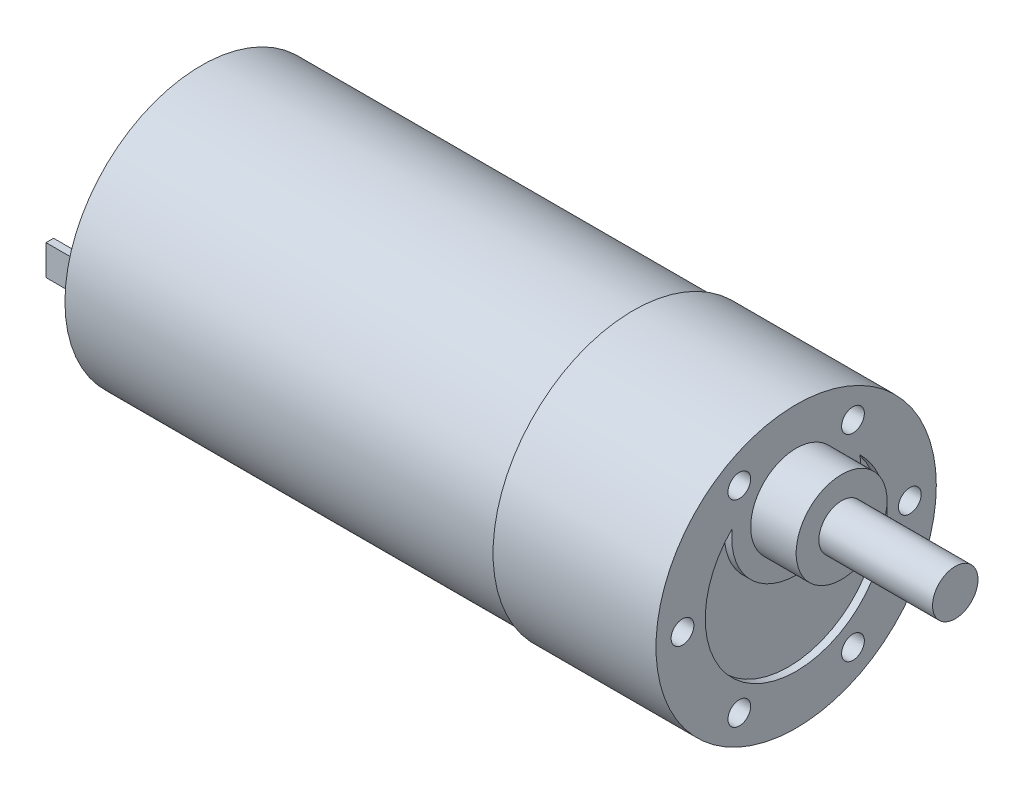
ISO-10303-21;
HEADER;
FILE_DESCRIPTION(('STEP AP214'),'2;1');
FILE_NAME('part.step','',(''),(''),'','','');
FILE_SCHEMA(('AUTOMOTIVE_DESIGN { 1 0 10303 214 1 1 1 1 }'));
ENDSEC;
DATA;
#1=APPLICATION_CONTEXT('core data for automotive mechanical design processes');
#2=APPLICATION_PROTOCOL_DEFINITION('international standard','automotive_design',2000,#1);
#3=PRODUCT_CONTEXT('',#1,'mechanical');
#4=PRODUCT('Part','Part','',(#3));
#5=PRODUCT_RELATED_PRODUCT_CATEGORY('part','',(#4));
#6=PRODUCT_DEFINITION_FORMATION('','',#4);
#7=PRODUCT_DEFINITION_CONTEXT('part definition',#1,'design');
#8=PRODUCT_DEFINITION('design','',#6,#7);
#9=PRODUCT_DEFINITION_SHAPE('','',#8);
#10=(LENGTH_UNIT() NAMED_UNIT(*) SI_UNIT(.MILLI.,.METRE.));
#11=(NAMED_UNIT(*) PLANE_ANGLE_UNIT() SI_UNIT($,.RADIAN.));
#12=(NAMED_UNIT(*) SI_UNIT($,.STERADIAN.) SOLID_ANGLE_UNIT());
#13=UNCERTAINTY_MEASURE_WITH_UNIT(LENGTH_MEASURE(1.E-05),#10,'distance_accuracy_value','');
#14=(GEOMETRIC_REPRESENTATION_CONTEXT(3) GLOBAL_UNCERTAINTY_ASSIGNED_CONTEXT((#13)) GLOBAL_UNIT_ASSIGNED_CONTEXT((#10,
#11,#12)) REPRESENTATION_CONTEXT('',''));
#15=CARTESIAN_POINT('',(0.,0.,0.));
#16=DIRECTION('',(0.,0.,1.));
#17=DIRECTION('',(1.,0.,0.));
#18=AXIS2_PLACEMENT_3D('',#15,#16,#17);
#19=CARTESIAN_POINT('',(21.5,0.,0.));
#20=DIRECTION('',(1.,0.,0.));
#21=DIRECTION('',(0.,0.,-1.));
#22=AXIS2_PLACEMENT_3D('',#19,#20,#21);
#23=PLANE('',#22);
#24=CARTESIAN_POINT('',(21.5,0.,15.));
#25=DIRECTION('',(1.,0.,0.));
#26=DIRECTION('',(0.,0.,-1.));
#27=AXIS2_PLACEMENT_3D('',#24,#25,#26);
#28=CIRCLE('',#27,1.5);
#29=CARTESIAN_POINT('',(21.5,0.,13.5));
#30=VERTEX_POINT('',#29);
#31=EDGE_CURVE('E377',#30,#30,#28,.T.);
#32=ORIENTED_EDGE('',*,*,#31,.F.);
#33=EDGE_LOOP('',(#32));
#34=FACE_BOUND('',#33,.T.);
#35=CARTESIAN_POINT('',(21.5,-12.9903810567665,7.50000000000015));
#36=DIRECTION('',(1.,0.,0.));
#37=DIRECTION('',(0.,0.,-1.));
#38=AXIS2_PLACEMENT_3D('',#35,#36,#37);
#39=CIRCLE('',#38,1.5);
#40=CARTESIAN_POINT('',(21.5,-12.9903810567665,6.00000000000014));
#41=VERTEX_POINT('',#40);
#42=EDGE_CURVE('E369',#41,#41,#39,.T.);
#43=ORIENTED_EDGE('',*,*,#42,.F.);
#44=EDGE_LOOP('',(#43));
#45=FACE_BOUND('',#44,.T.);
#46=CARTESIAN_POINT('',(21.5,-12.9903810567667,-7.49999999999988));
#47=DIRECTION('',(1.,0.,0.));
#48=DIRECTION('',(0.,0.,-1.));
#49=AXIS2_PLACEMENT_3D('',#46,#47,#48);
#50=CIRCLE('',#49,1.5);
#51=CARTESIAN_POINT('',(21.5,-12.9903810567667,-8.99999999999988));
#52=VERTEX_POINT('',#51);
#53=EDGE_CURVE('E362',#52,#52,#50,.T.);
#54=ORIENTED_EDGE('',*,*,#53,.F.);
#55=EDGE_LOOP('',(#54));
#56=FACE_BOUND('',#55,.T.);
#57=CARTESIAN_POINT('',(21.5,-1.02907469966573E-13,-15.));
#58=DIRECTION('',(1.,0.,0.));
#59=DIRECTION('',(0.,0.,-1.));
#60=AXIS2_PLACEMENT_3D('',#57,#58,#59);
#61=CIRCLE('',#60,1.5);
#62=CARTESIAN_POINT('',(21.5,-1.02907469966573E-13,-16.5));
#63=VERTEX_POINT('',#62);
#64=EDGE_CURVE('E367',#63,#63,#61,.T.);
#65=ORIENTED_EDGE('',*,*,#64,.F.);
#66=EDGE_LOOP('',(#65));
#67=FACE_BOUND('',#66,.T.);
#68=CARTESIAN_POINT('',(21.5,12.9903810567666,-7.50000000000006));
#69=DIRECTION('',(1.,0.,0.));
#70=DIRECTION('',(0.,0.,-1.));
#71=AXIS2_PLACEMENT_3D('',#68,#69,#70);
#72=CIRCLE('',#71,1.5);
#73=CARTESIAN_POINT('',(21.5,12.9903810567666,-9.00000000000006));
#74=VERTEX_POINT('',#73);
#75=EDGE_CURVE('E383',#74,#74,#72,.T.);
#76=ORIENTED_EDGE('',*,*,#75,.F.);
#77=EDGE_LOOP('',(#76));
#78=FACE_BOUND('',#77,.T.);
#79=CARTESIAN_POINT('',(21.5,12.9903810567666,7.49999999999997));
#80=DIRECTION('',(1.,0.,0.));
#81=DIRECTION('',(0.,0.,-1.));
#82=AXIS2_PLACEMENT_3D('',#79,#80,#81);
#83=CIRCLE('',#82,1.5);
#84=CARTESIAN_POINT('',(21.5,12.9903810567666,5.99999999999997));
#85=VERTEX_POINT('',#84);
#86=EDGE_CURVE('E386',#85,#85,#83,.T.);
#87=ORIENTED_EDGE('',*,*,#86,.F.);
#88=EDGE_LOOP('',(#87));
#89=FACE_BOUND('',#88,.T.);
#90=CARTESIAN_POINT('',(21.5,7.5,0.));
#91=DIRECTION('',(1.,0.,0.));
#92=DIRECTION('',(0.,0.,-1.));
#93=AXIS2_PLACEMENT_3D('',#90,#91,#92);
#94=CIRCLE('',#93,6.);
#95=CARTESIAN_POINT('',(21.5,7.5,-6.));
#96=VERTEX_POINT('',#95);
#97=EDGE_CURVE('E142',#96,#96,#94,.T.);
#98=ORIENTED_EDGE('',*,*,#97,.F.);
#99=EDGE_LOOP('',(#98));
#100=FACE_BOUND('',#99,.T.);
#101=CARTESIAN_POINT('',(21.5,0.,0.));
#102=DIRECTION('',(1.,0.,0.));
#103=DIRECTION('',(0.,0.,-1.));
#104=AXIS2_PLACEMENT_3D('',#101,#102,#103);
#105=CIRCLE('',#104,18.5);
#106=CARTESIAN_POINT('',(21.5,0.,-18.5));
#107=VERTEX_POINT('',#106);
#108=EDGE_CURVE('E47',#107,#107,#105,.T.);
#109=ORIENTED_EDGE('',*,*,#108,.T.);
#110=EDGE_LOOP('',(#109));
#111=FACE_BOUND('',#110,.T.);
#112=CARTESIAN_POINT('',(21.5,0.,0.));
#113=DIRECTION('',(1.,0.,0.));
#114=DIRECTION('',(0.,0.,-1.));
#115=AXIS2_PLACEMENT_3D('',#112,#113,#114);
#116=CIRCLE('',#115,12.);
#117=CARTESIAN_POINT('',(21.5,8.53333333333334,8.4369557437634));
#118=VERTEX_POINT('',#117);
#119=CARTESIAN_POINT('',(21.5,8.53333333333333,-8.4369557437634));
#120=VERTEX_POINT('',#119);
#121=EDGE_CURVE('E128',#118,#120,#116,.T.);
#122=ORIENTED_EDGE('',*,*,#121,.F.);
#123=CARTESIAN_POINT('',(21.5,7.5,0.));
#124=DIRECTION('',(1.,0.,0.));
#125=DIRECTION('',(0.,0.,-1.));
#126=AXIS2_PLACEMENT_3D('',#123,#124,#125);
#127=CIRCLE('',#126,8.5);
#128=EDGE_CURVE('E54',#118,#120,#127,.T.);
#129=ORIENTED_EDGE('',*,*,#128,.T.);
#130=EDGE_LOOP('',(#122,#129));
#131=FACE_BOUND('',#130,.T.);
#132=ADVANCED_FACE('F39',(#34,#45,#56,#67,#78,#89,#100,#111,#131),#23,.T.);
#133=CARTESIAN_POINT('',(-57.,0.,0.));
#134=DIRECTION('',(-1.,0.,0.));
#135=DIRECTION('',(0.,0.,1.));
#136=AXIS2_PLACEMENT_3D('',#133,#134,#135);
#137=PLANE('',#136);
#138=DIRECTION('',(0.,0.,-1.));
#139=VECTOR('',#138,1.);
#140=CARTESIAN_POINT('',(-57.,-2.00000000000001,-13.5));
#141=LINE('',#140,#139);
#142=CARTESIAN_POINT('',(-57.,-2.00000000000001,-13.5));
#143=VERTEX_POINT('',#142);
#144=CARTESIAN_POINT('',(-57.,-2.00000000000001,-14.5));
#145=VERTEX_POINT('',#144);
#146=EDGE_CURVE('E171',#143,#145,#141,.T.);
#147=ORIENTED_EDGE('',*,*,#146,.T.);
#148=DIRECTION('',(0.,1.,0.));
#149=VECTOR('',#148,1.);
#150=CARTESIAN_POINT('',(-57.,-2.00000000000001,-14.5));
#151=LINE('',#150,#149);
#152=CARTESIAN_POINT('',(-57.,1.99999999999999,-14.5));
#153=VERTEX_POINT('',#152);
#154=EDGE_CURVE('E194',#145,#153,#151,.T.);
#155=ORIENTED_EDGE('',*,*,#154,.T.);
#156=DIRECTION('',(0.,0.,-1.));
#157=VECTOR('',#156,1.);
#158=CARTESIAN_POINT('',(-57.,1.99999999999999,-13.5));
#159=LINE('',#158,#157);
#160=CARTESIAN_POINT('',(-57.,1.99999999999999,-13.5));
#161=VERTEX_POINT('',#160);
#162=EDGE_CURVE('E196',#161,#153,#159,.T.);
#163=ORIENTED_EDGE('',*,*,#162,.F.);
#164=DIRECTION('',(0.,1.,0.));
#165=VECTOR('',#164,1.);
#166=CARTESIAN_POINT('',(-57.,-2.00000000000001,-13.5));
#167=LINE('',#166,#165);
#168=EDGE_CURVE('E185',#143,#161,#167,.T.);
#169=ORIENTED_EDGE('',*,*,#168,.F.);
#170=EDGE_LOOP('',(#147,#155,#163,#169));
#171=FACE_BOUND('',#170,.T.);
#172=CARTESIAN_POINT('',(-57.,0.,0.));
#173=DIRECTION('',(-1.,0.,0.));
#174=DIRECTION('',(0.,0.,1.));
#175=AXIS2_PLACEMENT_3D('',#172,#173,#174);
#176=CIRCLE('',#175,18.);
#177=CARTESIAN_POINT('',(-57.,0.,18.));
#178=VERTEX_POINT('',#177);
#179=EDGE_CURVE('E204',#178,#178,#176,.T.);
#180=ORIENTED_EDGE('',*,*,#179,.T.);
#181=EDGE_LOOP('',(#180));
#182=FACE_BOUND('',#181,.T.);
#183=DIRECTION('',(0.,1.,0.));
#184=VECTOR('',#183,1.);
#185=CARTESIAN_POINT('',(-57.,-2.,14.5));
#186=LINE('',#185,#184);
#187=CARTESIAN_POINT('',(-57.,-2.,14.5));
#188=VERTEX_POINT('',#187);
#189=CARTESIAN_POINT('',(-57.,2.,14.5));
#190=VERTEX_POINT('',#189);
#191=EDGE_CURVE('E62',#188,#190,#186,.T.);
#192=ORIENTED_EDGE('',*,*,#191,.F.);
#193=DIRECTION('',(0.,0.,1.));
#194=VECTOR('',#193,1.);
#195=CARTESIAN_POINT('',(-57.,-2.,13.5));
#196=LINE('',#195,#194);
#197=CARTESIAN_POINT('',(-57.,-2.,13.5));
#198=VERTEX_POINT('',#197);
#199=EDGE_CURVE('E168',#198,#188,#196,.T.);
#200=ORIENTED_EDGE('',*,*,#199,.F.);
#201=DIRECTION('',(0.,1.,0.));
#202=VECTOR('',#201,1.);
#203=CARTESIAN_POINT('',(-57.,-2.,13.5));
#204=LINE('',#203,#202);
#205=CARTESIAN_POINT('',(-57.,2.,13.5));
#206=VERTEX_POINT('',#205);
#207=EDGE_CURVE('E162',#198,#206,#204,.T.);
#208=ORIENTED_EDGE('',*,*,#207,.T.);
#209=DIRECTION('',(0.,0.,1.));
#210=VECTOR('',#209,1.);
#211=CARTESIAN_POINT('',(-57.,2.,13.5));
#212=LINE('',#211,#210);
#213=EDGE_CURVE('E164',#206,#190,#212,.T.);
#214=ORIENTED_EDGE('',*,*,#213,.T.);
#215=EDGE_LOOP('',(#192,#200,#208,#214));
#216=FACE_BOUND('',#215,.T.);
#217=ADVANCED_FACE('F232',(#171,#182,#216),#137,.T.);
#218=CARTESIAN_POINT('',(21.5,0.,0.));
#219=DIRECTION('',(-1.,0.,0.));
#220=DIRECTION('',(0.,0.,1.));
#221=AXIS2_PLACEMENT_3D('',#218,#219,#220);
#222=CYLINDRICAL_SURFACE('',#221,18.5);
#223=ORIENTED_EDGE('',*,*,#108,.F.);
#224=EDGE_LOOP('',(#223));
#225=FACE_BOUND('',#224,.T.);
#226=CARTESIAN_POINT('',(0.,0.,0.));
#227=DIRECTION('',(1.,0.,0.));
#228=DIRECTION('',(0.,0.,-1.));
#229=AXIS2_PLACEMENT_3D('',#226,#227,#228);
#230=CIRCLE('',#229,18.5);
#231=CARTESIAN_POINT('',(0.,0.,-18.5));
#232=VERTEX_POINT('',#231);
#233=EDGE_CURVE('E215',#232,#232,#230,.T.);
#234=ORIENTED_EDGE('',*,*,#233,.T.);
#235=EDGE_LOOP('',(#234));
#236=FACE_BOUND('',#235,.T.);
#237=ADVANCED_FACE('F41',(#225,#236),#222,.T.);
#238=CARTESIAN_POINT('',(0.,0.,0.));
#239=DIRECTION('',(1.,0.,0.));
#240=DIRECTION('',(0.,0.,-1.));
#241=AXIS2_PLACEMENT_3D('',#238,#239,#240);
#242=PLANE('',#241);
#243=CARTESIAN_POINT('',(0.,0.,0.));
#244=DIRECTION('',(1.,0.,0.));
#245=DIRECTION('',(0.,0.,-1.));
#246=AXIS2_PLACEMENT_3D('',#243,#244,#245);
#247=CIRCLE('',#246,18.);
#248=CARTESIAN_POINT('',(0.,0.,-18.));
#249=VERTEX_POINT('',#248);
#250=EDGE_CURVE('E11',#249,#249,#247,.F.);
#251=ORIENTED_EDGE('',*,*,#250,.F.);
#252=EDGE_LOOP('',(#251));
#253=FACE_BOUND('',#252,.T.);
#254=ORIENTED_EDGE('',*,*,#233,.F.);
#255=EDGE_LOOP('',(#254));
#256=FACE_BOUND('',#255,.T.);
#257=ADVANCED_FACE('F221',(#253,#256),#242,.F.);
#258=CARTESIAN_POINT('',(-57.,0.,0.));
#259=DIRECTION('',(1.,0.,0.));
#260=DIRECTION('',(0.,0.,-1.));
#261=AXIS2_PLACEMENT_3D('',#258,#259,#260);
#262=CYLINDRICAL_SURFACE('',#261,18.);
#263=ORIENTED_EDGE('',*,*,#179,.F.);
#264=EDGE_LOOP('',(#263));
#265=FACE_BOUND('',#264,.T.);
#266=ORIENTED_EDGE('',*,*,#250,.T.);
#267=EDGE_LOOP('',(#266));
#268=FACE_BOUND('',#267,.T.);
#269=ADVANCED_FACE('F223',(#265,#268),#262,.T.);
#270=CARTESIAN_POINT('',(-63.,-2.00000000000001,-13.5));
#271=DIRECTION('',(0.,-1.,0.));
#272=DIRECTION('',(0.,0.,-1.));
#273=AXIS2_PLACEMENT_3D('',#270,#271,#272);
#274=PLANE('',#273);
#275=ORIENTED_EDGE('',*,*,#146,.F.);
#276=DIRECTION('',(1.,0.,0.));
#277=VECTOR('',#276,1.);
#278=CARTESIAN_POINT('',(-63.,-2.00000000000001,-13.5));
#279=LINE('',#278,#277);
#280=CARTESIAN_POINT('',(-63.,-2.00000000000001,-13.5));
#281=VERTEX_POINT('',#280);
#282=EDGE_CURVE('E201',#281,#143,#279,.T.);
#283=ORIENTED_EDGE('',*,*,#282,.F.);
#284=DIRECTION('',(0.,0.,-1.));
#285=VECTOR('',#284,1.);
#286=CARTESIAN_POINT('',(-63.,-2.00000000000001,-13.5));
#287=LINE('',#286,#285);
#288=CARTESIAN_POINT('',(-63.,-2.00000000000001,-14.5));
#289=VERTEX_POINT('',#288);
#290=EDGE_CURVE('E181',#281,#289,#287,.T.);
#291=ORIENTED_EDGE('',*,*,#290,.T.);
#292=DIRECTION('',(1.,0.,0.));
#293=VECTOR('',#292,1.);
#294=CARTESIAN_POINT('',(-63.,-2.00000000000001,-14.5));
#295=LINE('',#294,#293);
#296=EDGE_CURVE('E192',#289,#145,#295,.T.);
#297=ORIENTED_EDGE('',*,*,#296,.T.);
#298=EDGE_LOOP('',(#275,#283,#291,#297));
#299=FACE_BOUND('',#298,.T.);
#300=ADVANCED_FACE('F229',(#299),#274,.T.);
#301=CARTESIAN_POINT('',(-63.,-2.00000000000001,-13.5));
#302=DIRECTION('',(0.,0.,-1.));
#303=DIRECTION('',(-1.,0.,0.));
#304=AXIS2_PLACEMENT_3D('',#301,#302,#303);
#305=PLANE('',#304);
#306=ORIENTED_EDGE('',*,*,#168,.T.);
#307=DIRECTION('',(1.,0.,0.));
#308=VECTOR('',#307,1.);
#309=CARTESIAN_POINT('',(-63.,1.99999999999999,-13.5));
#310=LINE('',#309,#308);
#311=CARTESIAN_POINT('',(-63.,1.99999999999999,-13.5));
#312=VERTEX_POINT('',#311);
#313=EDGE_CURVE('E205',#312,#161,#310,.T.);
#314=ORIENTED_EDGE('',*,*,#313,.F.);
#315=DIRECTION('',(0.,1.,0.));
#316=VECTOR('',#315,1.);
#317=CARTESIAN_POINT('',(-63.,-2.00000000000001,-13.5));
#318=LINE('',#317,#316);
#319=EDGE_CURVE('E190',#281,#312,#318,.T.);
#320=ORIENTED_EDGE('',*,*,#319,.F.);
#321=ORIENTED_EDGE('',*,*,#282,.T.);
#322=EDGE_LOOP('',(#306,#314,#320,#321));
#323=FACE_BOUND('',#322,.T.);
#324=ADVANCED_FACE('F248',(#323),#305,.F.);
#325=CARTESIAN_POINT('',(-63.,1.99999999999999,-13.5));
#326=DIRECTION('',(0.,-1.,0.));
#327=DIRECTION('',(0.,0.,-1.));
#328=AXIS2_PLACEMENT_3D('',#325,#326,#327);
#329=PLANE('',#328);
#330=ORIENTED_EDGE('',*,*,#162,.T.);
#331=DIRECTION('',(1.,0.,0.));
#332=VECTOR('',#331,1.);
#333=CARTESIAN_POINT('',(-63.,1.99999999999999,-14.5));
#334=LINE('',#333,#332);
#335=CARTESIAN_POINT('',(-63.,1.99999999999999,-14.5));
#336=VERTEX_POINT('',#335);
#337=EDGE_CURVE('E208',#336,#153,#334,.T.);
#338=ORIENTED_EDGE('',*,*,#337,.F.);
#339=DIRECTION('',(0.,0.,-1.));
#340=VECTOR('',#339,1.);
#341=CARTESIAN_POINT('',(-63.,1.99999999999999,-13.5));
#342=LINE('',#341,#340);
#343=EDGE_CURVE('E188',#312,#336,#342,.T.);
#344=ORIENTED_EDGE('',*,*,#343,.F.);
#345=ORIENTED_EDGE('',*,*,#313,.T.);
#346=EDGE_LOOP('',(#330,#338,#344,#345));
#347=FACE_BOUND('',#346,.T.);
#348=ADVANCED_FACE('F254',(#347),#329,.F.);
#349=CARTESIAN_POINT('',(-63.,-2.00000000000001,-14.5));
#350=DIRECTION('',(0.,0.,-1.));
#351=DIRECTION('',(-1.,0.,0.));
#352=AXIS2_PLACEMENT_3D('',#349,#350,#351);
#353=PLANE('',#352);
#354=ORIENTED_EDGE('',*,*,#154,.F.);
#355=ORIENTED_EDGE('',*,*,#296,.F.);
#356=DIRECTION('',(0.,1.,0.));
#357=VECTOR('',#356,1.);
#358=CARTESIAN_POINT('',(-63.,-2.00000000000001,-14.5));
#359=LINE('',#358,#357);
#360=EDGE_CURVE('E184',#289,#336,#359,.T.);
#361=ORIENTED_EDGE('',*,*,#360,.T.);
#362=ORIENTED_EDGE('',*,*,#337,.T.);
#363=EDGE_LOOP('',(#354,#355,#361,#362));
#364=FACE_BOUND('',#363,.T.);
#365=ADVANCED_FACE('F250',(#364),#353,.T.);
#366=CARTESIAN_POINT('',(-63.,0.,0.));
#367=DIRECTION('',(1.,0.,0.));
#368=DIRECTION('',(0.,0.,-1.));
#369=AXIS2_PLACEMENT_3D('',#366,#367,#368);
#370=PLANE('',#369);
#371=ORIENTED_EDGE('',*,*,#290,.F.);
#372=ORIENTED_EDGE('',*,*,#319,.T.);
#373=ORIENTED_EDGE('',*,*,#343,.T.);
#374=ORIENTED_EDGE('',*,*,#360,.F.);
#375=EDGE_LOOP('',(#371,#372,#373,#374));
#376=FACE_BOUND('',#375,.T.);
#377=ADVANCED_FACE('F253',(#376),#370,.F.);
#378=CARTESIAN_POINT('',(-63.,-2.,13.5));
#379=DIRECTION('',(0.,1.,0.));
#380=DIRECTION('',(0.,0.,1.));
#381=AXIS2_PLACEMENT_3D('',#378,#379,#380);
#382=PLANE('',#381);
#383=ORIENTED_EDGE('',*,*,#199,.T.);
#384=DIRECTION('',(1.,0.,0.));
#385=VECTOR('',#384,1.);
#386=CARTESIAN_POINT('',(-63.,-2.,14.5));
#387=LINE('',#386,#385);
#388=CARTESIAN_POINT('',(-63.,-2.,14.5));
#389=VERTEX_POINT('',#388);
#390=EDGE_CURVE('E148',#389,#188,#387,.T.);
#391=ORIENTED_EDGE('',*,*,#390,.F.);
#392=DIRECTION('',(0.,0.,1.));
#393=VECTOR('',#392,1.);
#394=CARTESIAN_POINT('',(-63.,-2.,13.5));
#395=LINE('',#394,#393);
#396=CARTESIAN_POINT('',(-63.,-2.,13.5));
#397=VERTEX_POINT('',#396);
#398=EDGE_CURVE('E165',#397,#389,#395,.T.);
#399=ORIENTED_EDGE('',*,*,#398,.F.);
#400=DIRECTION('',(1.,0.,0.));
#401=VECTOR('',#400,1.);
#402=CARTESIAN_POINT('',(-63.,-2.,13.5));
#403=LINE('',#402,#401);
#404=EDGE_CURVE('E158',#397,#198,#403,.T.);
#405=ORIENTED_EDGE('',*,*,#404,.T.);
#406=EDGE_LOOP('',(#383,#391,#399,#405));
#407=FACE_BOUND('',#406,.T.);
#408=ADVANCED_FACE('F264',(#407),#382,.F.);
#409=CARTESIAN_POINT('',(-63.,-2.,14.5));
#410=DIRECTION('',(0.,0.,-1.));
#411=DIRECTION('',(-1.,0.,0.));
#412=AXIS2_PLACEMENT_3D('',#409,#410,#411);
#413=PLANE('',#412);
#414=ORIENTED_EDGE('',*,*,#191,.T.);
#415=DIRECTION('',(1.,0.,0.));
#416=VECTOR('',#415,1.);
#417=CARTESIAN_POINT('',(-63.,2.,14.5));
#418=LINE('',#417,#416);
#419=CARTESIAN_POINT('',(-63.,2.,14.5));
#420=VERTEX_POINT('',#419);
#421=EDGE_CURVE('E152',#420,#190,#418,.T.);
#422=ORIENTED_EDGE('',*,*,#421,.F.);
#423=DIRECTION('',(0.,1.,0.));
#424=VECTOR('',#423,1.);
#425=CARTESIAN_POINT('',(-63.,-2.,14.5));
#426=LINE('',#425,#424);
#427=EDGE_CURVE('E177',#389,#420,#426,.T.);
#428=ORIENTED_EDGE('',*,*,#427,.F.);
#429=ORIENTED_EDGE('',*,*,#390,.T.);
#430=EDGE_LOOP('',(#414,#422,#428,#429));
#431=FACE_BOUND('',#430,.T.);
#432=ADVANCED_FACE('F278',(#431),#413,.F.);
#433=CARTESIAN_POINT('',(-63.,2.,13.5));
#434=DIRECTION('',(0.,1.,0.));
#435=DIRECTION('',(0.,0.,1.));
#436=AXIS2_PLACEMENT_3D('',#433,#434,#435);
#437=PLANE('',#436);
#438=ORIENTED_EDGE('',*,*,#213,.F.);
#439=DIRECTION('',(1.,0.,0.));
#440=VECTOR('',#439,1.);
#441=CARTESIAN_POINT('',(-63.,2.,13.5));
#442=LINE('',#441,#440);
#443=CARTESIAN_POINT('',(-63.,2.,13.5));
#444=VERTEX_POINT('',#443);
#445=EDGE_CURVE('E155',#444,#206,#442,.T.);
#446=ORIENTED_EDGE('',*,*,#445,.F.);
#447=DIRECTION('',(0.,0.,1.));
#448=VECTOR('',#447,1.);
#449=CARTESIAN_POINT('',(-63.,2.,13.5));
#450=LINE('',#449,#448);
#451=EDGE_CURVE('E174',#444,#420,#450,.T.);
#452=ORIENTED_EDGE('',*,*,#451,.T.);
#453=ORIENTED_EDGE('',*,*,#421,.T.);
#454=EDGE_LOOP('',(#438,#446,#452,#453));
#455=FACE_BOUND('',#454,.T.);
#456=ADVANCED_FACE('F274',(#455),#437,.T.);
#457=CARTESIAN_POINT('',(-63.,-2.,13.5));
#458=DIRECTION('',(0.,0.,-1.));
#459=DIRECTION('',(-1.,0.,0.));
#460=AXIS2_PLACEMENT_3D('',#457,#458,#459);
#461=PLANE('',#460);
#462=ORIENTED_EDGE('',*,*,#207,.F.);
#463=ORIENTED_EDGE('',*,*,#404,.F.);
#464=DIRECTION('',(0.,1.,0.));
#465=VECTOR('',#464,1.);
#466=CARTESIAN_POINT('',(-63.,-2.,13.5));
#467=LINE('',#466,#465);
#468=EDGE_CURVE('E161',#397,#444,#467,.T.);
#469=ORIENTED_EDGE('',*,*,#468,.T.);
#470=ORIENTED_EDGE('',*,*,#445,.T.);
#471=EDGE_LOOP('',(#462,#463,#469,#470));
#472=FACE_BOUND('',#471,.T.);
#473=ADVANCED_FACE('F270',(#472),#461,.T.);
#474=CARTESIAN_POINT('',(-63.,0.,0.));
#475=DIRECTION('',(-1.,0.,0.));
#476=DIRECTION('',(0.,0.,1.));
#477=AXIS2_PLACEMENT_3D('',#474,#475,#476);
#478=PLANE('',#477);
#479=ORIENTED_EDGE('',*,*,#398,.T.);
#480=ORIENTED_EDGE('',*,*,#427,.T.);
#481=ORIENTED_EDGE('',*,*,#451,.F.);
#482=ORIENTED_EDGE('',*,*,#468,.F.);
#483=EDGE_LOOP('',(#479,#480,#481,#482));
#484=FACE_BOUND('',#483,.T.);
#485=ADVANCED_FACE('F266',(#484),#478,.T.);
#486=CARTESIAN_POINT('',(27.5,7.5,0.));
#487=DIRECTION('',(-1.,0.,0.));
#488=DIRECTION('',(0.,0.,1.));
#489=AXIS2_PLACEMENT_3D('',#486,#487,#488);
#490=CYLINDRICAL_SURFACE('',#489,6.);
#491=CARTESIAN_POINT('',(27.5,7.5,0.));
#492=DIRECTION('',(1.,0.,0.));
#493=DIRECTION('',(0.,0.,-1.));
#494=AXIS2_PLACEMENT_3D('',#491,#492,#493);
#495=CIRCLE('',#494,6.);
#496=CARTESIAN_POINT('',(27.5,7.5,-6.));
#497=VERTEX_POINT('',#496);
#498=EDGE_CURVE('E145',#497,#497,#495,.T.);
#499=ORIENTED_EDGE('',*,*,#498,.F.);
#500=EDGE_LOOP('',(#499));
#501=FACE_BOUND('',#500,.T.);
#502=ORIENTED_EDGE('',*,*,#97,.T.);
#503=EDGE_LOOP('',(#502));
#504=FACE_BOUND('',#503,.T.);
#505=ADVANCED_FACE('F269',(#501,#504),#490,.T.);
#506=CARTESIAN_POINT('',(27.5,0.,0.));
#507=DIRECTION('',(1.,0.,0.));
#508=DIRECTION('',(0.,0.,-1.));
#509=AXIS2_PLACEMENT_3D('',#506,#507,#508);
#510=PLANE('',#509);
#511=CARTESIAN_POINT('',(27.5,7.5,0.));
#512=DIRECTION('',(1.,0.,0.));
#513=DIRECTION('',(0.,0.,-1.));
#514=AXIS2_PLACEMENT_3D('',#511,#512,#513);
#515=CIRCLE('',#514,3.);
#516=CARTESIAN_POINT('',(27.5,7.5,-3.));
#517=VERTEX_POINT('',#516);
#518=EDGE_CURVE('E137',#517,#517,#515,.T.);
#519=ORIENTED_EDGE('',*,*,#518,.F.);
#520=EDGE_LOOP('',(#519));
#521=FACE_BOUND('',#520,.T.);
#522=ORIENTED_EDGE('',*,*,#498,.T.);
#523=EDGE_LOOP('',(#522));
#524=FACE_BOUND('',#523,.T.);
#525=ADVANCED_FACE('F288',(#521,#524),#510,.T.);
#526=CARTESIAN_POINT('',(42.5,7.5,0.));
#527=DIRECTION('',(-1.,0.,0.));
#528=DIRECTION('',(0.,0.,1.));
#529=AXIS2_PLACEMENT_3D('',#526,#527,#528);
#530=CYLINDRICAL_SURFACE('',#529,3.);
#531=CARTESIAN_POINT('',(42.5,7.5,0.));
#532=DIRECTION('',(1.,0.,0.));
#533=DIRECTION('',(0.,0.,-1.));
#534=AXIS2_PLACEMENT_3D('',#531,#532,#533);
#535=CIRCLE('',#534,3.);
#536=CARTESIAN_POINT('',(42.5,7.5,-3.));
#537=VERTEX_POINT('',#536);
#538=EDGE_CURVE('E139',#537,#537,#535,.T.);
#539=ORIENTED_EDGE('',*,*,#538,.F.);
#540=EDGE_LOOP('',(#539));
#541=FACE_BOUND('',#540,.T.);
#542=ORIENTED_EDGE('',*,*,#518,.T.);
#543=EDGE_LOOP('',(#542));
#544=FACE_BOUND('',#543,.T.);
#545=ADVANCED_FACE('F292',(#541,#544),#530,.T.);
#546=CARTESIAN_POINT('',(42.5,7.5,0.));
#547=DIRECTION('',(1.,0.,0.));
#548=DIRECTION('',(0.,0.,-1.));
#549=AXIS2_PLACEMENT_3D('',#546,#547,#548);
#550=PLANE('',#549);
#551=ORIENTED_EDGE('',*,*,#538,.T.);
#552=EDGE_LOOP('',(#551));
#553=FACE_BOUND('',#552,.T.);
#554=ADVANCED_FACE('F296',(#553),#550,.T.);
#555=CARTESIAN_POINT('',(20.5,7.5,0.));
#556=DIRECTION('',(1.,0.,0.));
#557=DIRECTION('',(0.,0.,-1.));
#558=AXIS2_PLACEMENT_3D('',#555,#556,#557);
#559=CYLINDRICAL_SURFACE('',#558,8.5);
#560=ORIENTED_EDGE('',*,*,#128,.F.);
#561=DIRECTION('',(1.,0.,0.));
#562=VECTOR('',#561,1.);
#563=CARTESIAN_POINT('',(20.5,8.53333333333334,8.4369557437634));
#564=LINE('',#563,#562);
#565=CARTESIAN_POINT('',(20.5,8.53333333333334,8.4369557437634));
#566=VERTEX_POINT('',#565);
#567=EDGE_CURVE('E113',#566,#118,#564,.T.);
#568=ORIENTED_EDGE('',*,*,#567,.F.);
#569=CARTESIAN_POINT('',(20.5,7.5,0.));
#570=DIRECTION('',(1.,0.,0.));
#571=DIRECTION('',(0.,0.,-1.));
#572=AXIS2_PLACEMENT_3D('',#569,#570,#571);
#573=CIRCLE('',#572,8.5);
#574=CARTESIAN_POINT('',(20.5,8.53333333333333,-8.4369557437634));
#575=VERTEX_POINT('',#574);
#576=EDGE_CURVE('E116',#566,#575,#573,.T.);
#577=ORIENTED_EDGE('',*,*,#576,.T.);
#578=DIRECTION('',(1.,0.,0.));
#579=VECTOR('',#578,1.);
#580=CARTESIAN_POINT('',(20.5,8.53333333333333,-8.4369557437634));
#581=LINE('',#580,#579);
#582=EDGE_CURVE('E122',#575,#120,#581,.T.);
#583=ORIENTED_EDGE('',*,*,#582,.T.);
#584=EDGE_LOOP('',(#560,#568,#577,#583));
#585=FACE_BOUND('',#584,.T.);
#586=ADVANCED_FACE('F115',(#585),#559,.T.);
#587=CARTESIAN_POINT('',(20.5,0.,0.));
#588=DIRECTION('',(1.,0.,0.));
#589=DIRECTION('',(0.,0.,-1.));
#590=AXIS2_PLACEMENT_3D('',#587,#588,#589);
#591=CYLINDRICAL_SURFACE('',#590,12.);
#592=ORIENTED_EDGE('',*,*,#121,.T.);
#593=ORIENTED_EDGE('',*,*,#582,.F.);
#594=CARTESIAN_POINT('',(20.5,0.,0.));
#595=DIRECTION('',(1.,0.,0.));
#596=DIRECTION('',(0.,0.,-1.));
#597=AXIS2_PLACEMENT_3D('',#594,#595,#596);
#598=CIRCLE('',#597,12.);
#599=EDGE_CURVE('E123',#566,#575,#598,.T.);
#600=ORIENTED_EDGE('',*,*,#599,.F.);
#601=ORIENTED_EDGE('',*,*,#567,.T.);
#602=EDGE_LOOP('',(#592,#593,#600,#601));
#603=FACE_BOUND('',#602,.T.);
#604=ADVANCED_FACE('F130',(#603),#591,.F.);
#605=CARTESIAN_POINT('',(20.5,0.,0.));
#606=DIRECTION('',(1.,0.,0.));
#607=DIRECTION('',(0.,0.,-1.));
#608=AXIS2_PLACEMENT_3D('',#605,#606,#607);
#609=PLANE('',#608);
#610=ORIENTED_EDGE('',*,*,#576,.F.);
#611=ORIENTED_EDGE('',*,*,#599,.T.);
#612=EDGE_LOOP('',(#610,#611));
#613=FACE_BOUND('',#612,.T.);
#614=ADVANCED_FACE('F127',(#613),#609,.T.);
#615=CARTESIAN_POINT('',(16.5,12.9903810567666,7.49999999999997));
#616=DIRECTION('',(1.,0.,0.));
#617=DIRECTION('',(0.,0.,-1.));
#618=AXIS2_PLACEMENT_3D('',#615,#616,#617);
#619=CYLINDRICAL_SURFACE('',#618,1.5);
#620=CARTESIAN_POINT('',(16.5,12.9903810567666,7.49999999999997));
#621=DIRECTION('',(1.,0.,0.));
#622=DIRECTION('',(0.,0.,-1.));
#623=AXIS2_PLACEMENT_3D('',#620,#621,#622);
#624=CIRCLE('',#623,1.5);
#625=CARTESIAN_POINT('',(16.5,12.9903810567666,5.99999999999997));
#626=VERTEX_POINT('',#625);
#627=EDGE_CURVE('E135',#626,#626,#624,.T.);
#628=ORIENTED_EDGE('',*,*,#627,.F.);
#629=EDGE_LOOP('',(#628));
#630=FACE_BOUND('',#629,.T.);
#631=ORIENTED_EDGE('',*,*,#86,.T.);
#632=EDGE_LOOP('',(#631));
#633=FACE_BOUND('',#632,.T.);
#634=ADVANCED_FACE('F307',(#630,#633),#619,.F.);
#635=CARTESIAN_POINT('',(16.5,12.9903810567666,7.49999999999997));
#636=DIRECTION('',(1.,0.,0.));
#637=DIRECTION('',(0.,0.,-1.));
#638=AXIS2_PLACEMENT_3D('',#635,#636,#637);
#639=PLANE('',#638);
#640=ORIENTED_EDGE('',*,*,#627,.T.);
#641=EDGE_LOOP('',(#640));
#642=FACE_BOUND('',#641,.T.);
#643=ADVANCED_FACE('F310',(#642),#639,.T.);
#644=CARTESIAN_POINT('',(16.5,12.9903810567666,-7.50000000000006));
#645=DIRECTION('',(1.,0.,0.));
#646=DIRECTION('',(0.,0.,-1.));
#647=AXIS2_PLACEMENT_3D('',#644,#645,#646);
#648=CYLINDRICAL_SURFACE('',#647,1.5);
#649=CARTESIAN_POINT('',(16.5,12.9903810567666,-7.50000000000006));
#650=DIRECTION('',(1.,0.,0.));
#651=DIRECTION('',(0.,0.,-1.));
#652=AXIS2_PLACEMENT_3D('',#649,#650,#651);
#653=CIRCLE('',#652,1.5);
#654=CARTESIAN_POINT('',(16.5,12.9903810567666,-9.00000000000006));
#655=VERTEX_POINT('',#654);
#656=EDGE_CURVE('E387',#655,#655,#653,.T.);
#657=ORIENTED_EDGE('',*,*,#656,.F.);
#658=EDGE_LOOP('',(#657));
#659=FACE_BOUND('',#658,.T.);
#660=ORIENTED_EDGE('',*,*,#75,.T.);
#661=EDGE_LOOP('',(#660));
#662=FACE_BOUND('',#661,.T.);
#663=ADVANCED_FACE('F314',(#659,#662),#648,.F.);
#664=CARTESIAN_POINT('',(16.5,12.9903810567666,-7.50000000000006));
#665=DIRECTION('',(1.,0.,0.));
#666=DIRECTION('',(0.,0.,-1.));
#667=AXIS2_PLACEMENT_3D('',#664,#665,#666);
#668=PLANE('',#667);
#669=ORIENTED_EDGE('',*,*,#656,.T.);
#670=EDGE_LOOP('',(#669));
#671=FACE_BOUND('',#670,.T.);
#672=ADVANCED_FACE('F324',(#671),#668,.T.);
#673=CARTESIAN_POINT('',(16.5,-1.02907469966573E-13,-15.));
#674=DIRECTION('',(1.,0.,0.));
#675=DIRECTION('',(0.,0.,-1.));
#676=AXIS2_PLACEMENT_3D('',#673,#674,#675);
#677=CYLINDRICAL_SURFACE('',#676,1.5);
#678=CARTESIAN_POINT('',(16.5,-1.02907469966573E-13,-15.));
#679=DIRECTION('',(1.,0.,0.));
#680=DIRECTION('',(0.,0.,-1.));
#681=AXIS2_PLACEMENT_3D('',#678,#679,#680);
#682=CIRCLE('',#681,1.5);
#683=CARTESIAN_POINT('',(16.5,-1.02907469966573E-13,-16.5));
#684=VERTEX_POINT('',#683);
#685=EDGE_CURVE('E364',#684,#684,#682,.T.);
#686=ORIENTED_EDGE('',*,*,#685,.F.);
#687=EDGE_LOOP('',(#686));
#688=FACE_BOUND('',#687,.T.);
#689=ORIENTED_EDGE('',*,*,#64,.T.);
#690=EDGE_LOOP('',(#689));
#691=FACE_BOUND('',#690,.T.);
#692=ADVANCED_FACE('F320',(#688,#691),#677,.F.);
#693=CARTESIAN_POINT('',(16.5,-1.02907469966573E-13,-15.));
#694=DIRECTION('',(1.,0.,0.));
#695=DIRECTION('',(0.,0.,-1.));
#696=AXIS2_PLACEMENT_3D('',#693,#694,#695);
#697=PLANE('',#696);
#698=ORIENTED_EDGE('',*,*,#685,.T.);
#699=EDGE_LOOP('',(#698));
#700=FACE_BOUND('',#699,.T.);
#701=ADVANCED_FACE('F316',(#700),#697,.T.);
#702=CARTESIAN_POINT('',(16.5,-12.9903810567667,-7.49999999999988));
#703=DIRECTION('',(1.,0.,0.));
#704=DIRECTION('',(0.,0.,-1.));
#705=AXIS2_PLACEMENT_3D('',#702,#703,#704);
#706=CYLINDRICAL_SURFACE('',#705,1.5);
#707=CARTESIAN_POINT('',(16.5,-12.9903810567667,-7.49999999999988));
#708=DIRECTION('',(1.,0.,0.));
#709=DIRECTION('',(0.,0.,-1.));
#710=AXIS2_PLACEMENT_3D('',#707,#708,#709);
#711=CIRCLE('',#710,1.5);
#712=CARTESIAN_POINT('',(16.5,-12.9903810567667,-8.99999999999988));
#713=VERTEX_POINT('',#712);
#714=EDGE_CURVE('E359',#713,#713,#711,.T.);
#715=ORIENTED_EDGE('',*,*,#714,.F.);
#716=EDGE_LOOP('',(#715));
#717=FACE_BOUND('',#716,.T.);
#718=ORIENTED_EDGE('',*,*,#53,.T.);
#719=EDGE_LOOP('',(#718));
#720=FACE_BOUND('',#719,.T.);
#721=ADVANCED_FACE('F319',(#717,#720),#706,.F.);
#722=CARTESIAN_POINT('',(16.5,-12.9903810567667,-7.49999999999988));
#723=DIRECTION('',(1.,0.,0.));
#724=DIRECTION('',(0.,0.,-1.));
#725=AXIS2_PLACEMENT_3D('',#722,#723,#724);
#726=PLANE('',#725);
#727=ORIENTED_EDGE('',*,*,#714,.T.);
#728=EDGE_LOOP('',(#727));
#729=FACE_BOUND('',#728,.T.);
#730=ADVANCED_FACE('F347',(#729),#726,.T.);
#731=CARTESIAN_POINT('',(16.5,-12.9903810567665,7.50000000000015));
#732=DIRECTION('',(1.,0.,0.));
#733=DIRECTION('',(0.,0.,-1.));
#734=AXIS2_PLACEMENT_3D('',#731,#732,#733);
#735=CYLINDRICAL_SURFACE('',#734,1.5);
#736=CARTESIAN_POINT('',(16.5,-12.9903810567665,7.50000000000015));
#737=DIRECTION('',(1.,0.,0.));
#738=DIRECTION('',(0.,0.,-1.));
#739=AXIS2_PLACEMENT_3D('',#736,#737,#738);
#740=CIRCLE('',#739,1.5);
#741=CARTESIAN_POINT('',(16.5,-12.9903810567665,6.00000000000014));
#742=VERTEX_POINT('',#741);
#743=EDGE_CURVE('E374',#742,#742,#740,.T.);
#744=ORIENTED_EDGE('',*,*,#743,.F.);
#745=EDGE_LOOP('',(#744));
#746=FACE_BOUND('',#745,.T.);
#747=ORIENTED_EDGE('',*,*,#42,.T.);
#748=EDGE_LOOP('',(#747));
#749=FACE_BOUND('',#748,.T.);
#750=ADVANCED_FACE('F343',(#746,#749),#735,.F.);
#751=CARTESIAN_POINT('',(16.5,-12.9903810567665,7.50000000000015));
#752=DIRECTION('',(1.,0.,0.));
#753=DIRECTION('',(0.,0.,-1.));
#754=AXIS2_PLACEMENT_3D('',#751,#752,#753);
#755=PLANE('',#754);
#756=ORIENTED_EDGE('',*,*,#743,.T.);
#757=EDGE_LOOP('',(#756));
#758=FACE_BOUND('',#757,.T.);
#759=ADVANCED_FACE('F339',(#758),#755,.T.);
#760=CARTESIAN_POINT('',(16.5,0.,15.));
#761=DIRECTION('',(1.,0.,0.));
#762=DIRECTION('',(0.,0.,-1.));
#763=AXIS2_PLACEMENT_3D('',#760,#761,#762);
#764=CYLINDRICAL_SURFACE('',#763,1.5);
#765=CARTESIAN_POINT('',(16.5,0.,15.));
#766=DIRECTION('',(1.,0.,0.));
#767=DIRECTION('',(0.,0.,-1.));
#768=AXIS2_PLACEMENT_3D('',#765,#766,#767);
#769=CIRCLE('',#768,1.5);
#770=CARTESIAN_POINT('',(16.5,0.,13.5));
#771=VERTEX_POINT('',#770);
#772=EDGE_CURVE('E380',#771,#771,#769,.T.);
#773=ORIENTED_EDGE('',*,*,#772,.F.);
#774=EDGE_LOOP('',(#773));
#775=FACE_BOUND('',#774,.T.);
#776=ORIENTED_EDGE('',*,*,#31,.T.);
#777=EDGE_LOOP('',(#776));
#778=FACE_BOUND('',#777,.T.);
#779=ADVANCED_FACE('F335',(#775,#778),#764,.F.);
#780=CARTESIAN_POINT('',(16.5,0.,15.));
#781=DIRECTION('',(1.,0.,0.));
#782=DIRECTION('',(0.,0.,-1.));
#783=AXIS2_PLACEMENT_3D('',#780,#781,#782);
#784=PLANE('',#783);
#785=ORIENTED_EDGE('',*,*,#772,.T.);
#786=EDGE_LOOP('',(#785));
#787=FACE_BOUND('',#786,.T.);
#788=ADVANCED_FACE('F332',(#787),#784,.T.);
#789=CLOSED_SHELL('',(#132,#217,#237,#257,#269,#300,#324,#348,#365,#377,#408,#432,#456,#473,
#485,#505,#525,#545,#554,#586,#604,#614,#634,#643,#663,#672,#692,#701,#721,#730,#750,#759,#779,#788));
#790=MANIFOLD_SOLID_BREP('B2',#789);
#791=ADVANCED_BREP_SHAPE_REPRESENTATION('',(#18,#790),#14);
#792=SHAPE_DEFINITION_REPRESENTATION(#9,#791);
ENDSEC;
END-ISO-10303-21;
